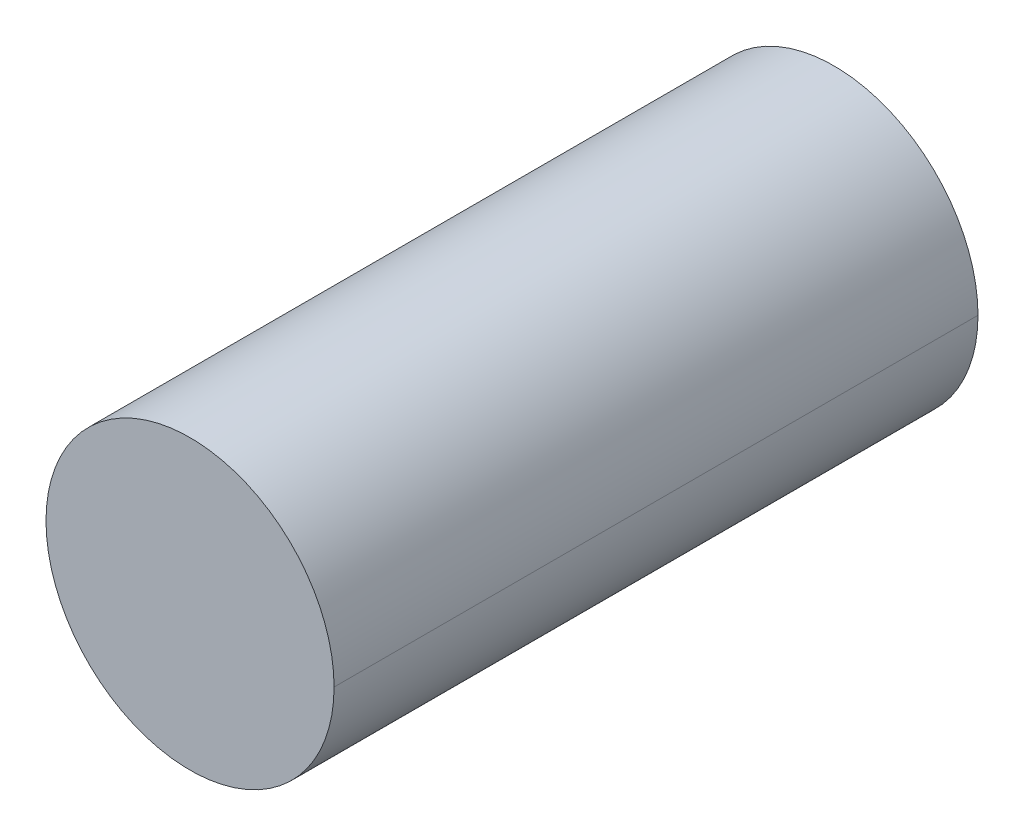
ISO-10303-21;
HEADER;
FILE_DESCRIPTION(('STEP AP214'),'2;1');
FILE_NAME('part.step','',(''),(''),'','','');
FILE_SCHEMA(('AUTOMOTIVE_DESIGN { 1 0 10303 214 1 1 1 1 }'));
ENDSEC;
DATA;
#1=APPLICATION_CONTEXT('core data for automotive mechanical design processes');
#2=APPLICATION_PROTOCOL_DEFINITION('international standard','automotive_design',2000,#1);
#3=PRODUCT_CONTEXT('',#1,'mechanical');
#4=PRODUCT('Part','Part','',(#3));
#5=PRODUCT_RELATED_PRODUCT_CATEGORY('part','',(#4));
#6=PRODUCT_DEFINITION_FORMATION('','',#4);
#7=PRODUCT_DEFINITION_CONTEXT('part definition',#1,'design');
#8=PRODUCT_DEFINITION('design','',#6,#7);
#9=PRODUCT_DEFINITION_SHAPE('','',#8);
#10=(LENGTH_UNIT() NAMED_UNIT(*) SI_UNIT(.MILLI.,.METRE.));
#11=(NAMED_UNIT(*) PLANE_ANGLE_UNIT() SI_UNIT($,.RADIAN.));
#12=(NAMED_UNIT(*) SI_UNIT($,.STERADIAN.) SOLID_ANGLE_UNIT());
#13=UNCERTAINTY_MEASURE_WITH_UNIT(LENGTH_MEASURE(1.E-05),#10,'distance_accuracy_value','');
#14=(GEOMETRIC_REPRESENTATION_CONTEXT(3) GLOBAL_UNCERTAINTY_ASSIGNED_CONTEXT((#13)) GLOBAL_UNIT_ASSIGNED_CONTEXT((#10,
#11,#12)) REPRESENTATION_CONTEXT('',''));
#15=CARTESIAN_POINT('',(0.,0.,0.));
#16=DIRECTION('',(0.,0.,1.));
#17=DIRECTION('',(1.,0.,0.));
#18=AXIS2_PLACEMENT_3D('',#15,#16,#17);
#19=CARTESIAN_POINT('',(0.,0.,0.));
#20=DIRECTION('',(0.,0.,1.));
#21=DIRECTION('',(1.,0.,0.));
#22=AXIS2_PLACEMENT_3D('',#19,#20,#21);
#23=PLANE('',#22);
#24=CARTESIAN_POINT('',(0.,0.,0.));
#25=DIRECTION('',(0.,0.,1.));
#26=DIRECTION('',(1.,0.,0.));
#27=AXIS2_PLACEMENT_3D('',#24,#25,#26);
#28=CIRCLE('',#27,4.25);
#29=CARTESIAN_POINT('',(-4.25,0.,0.));
#30=VERTEX_POINT('',#29);
#31=CARTESIAN_POINT('',(4.25,0.,0.));
#32=VERTEX_POINT('',#31);
#33=EDGE_CURVE('E9',#30,#32,#28,.T.);
#34=ORIENTED_EDGE('',*,*,#33,.F.);
#35=CARTESIAN_POINT('',(0.,0.,0.));
#36=DIRECTION('',(0.,0.,1.));
#37=DIRECTION('',(1.,0.,0.));
#38=AXIS2_PLACEMENT_3D('',#35,#36,#37);
#39=CIRCLE('',#38,4.25);
#40=EDGE_CURVE('E63',#32,#30,#39,.T.);
#41=ORIENTED_EDGE('',*,*,#40,.F.);
#42=EDGE_LOOP('',(#34,#41));
#43=FACE_BOUND('',#42,.T.);
#44=ADVANCED_FACE('F14',(#43),#23,.F.);
#45=CARTESIAN_POINT('',(0.,0.,19.));
#46=DIRECTION('',(0.,0.,1.));
#47=DIRECTION('',(1.,0.,0.));
#48=AXIS2_PLACEMENT_3D('',#45,#46,#47);
#49=PLANE('',#48);
#50=CARTESIAN_POINT('',(0.,0.,19.));
#51=DIRECTION('',(0.,0.,1.));
#52=DIRECTION('',(1.,0.,0.));
#53=AXIS2_PLACEMENT_3D('',#50,#51,#52);
#54=CIRCLE('',#53,4.25);
#55=CARTESIAN_POINT('',(-4.25,0.,19.));
#56=VERTEX_POINT('',#55);
#57=CARTESIAN_POINT('',(4.25,0.,19.));
#58=VERTEX_POINT('',#57);
#59=EDGE_CURVE('E22',#56,#58,#54,.T.);
#60=ORIENTED_EDGE('',*,*,#59,.T.);
#61=CARTESIAN_POINT('',(0.,0.,19.));
#62=DIRECTION('',(0.,0.,1.));
#63=DIRECTION('',(1.,0.,0.));
#64=AXIS2_PLACEMENT_3D('',#61,#62,#63);
#65=CIRCLE('',#64,4.25);
#66=EDGE_CURVE('E52',#58,#56,#65,.T.);
#67=ORIENTED_EDGE('',*,*,#66,.T.);
#68=EDGE_LOOP('',(#60,#67));
#69=FACE_BOUND('',#68,.T.);
#70=ADVANCED_FACE('F50',(#69),#49,.T.);
#71=CARTESIAN_POINT('',(0.,0.,19.));
#72=DIRECTION('',(0.,0.,-1.));
#73=DIRECTION('',(-1.,0.,0.));
#74=AXIS2_PLACEMENT_3D('',#71,#72,#73);
#75=CYLINDRICAL_SURFACE('',#74,4.25);
#76=DIRECTION('',(0.,0.,-1.));
#77=VECTOR('',#76,1.);
#78=CARTESIAN_POINT('',(4.25,0.,19.));
#79=LINE('',#78,#77);
#80=EDGE_CURVE('E58',#58,#32,#79,.T.);
#81=ORIENTED_EDGE('',*,*,#80,.F.);
#82=ORIENTED_EDGE('',*,*,#59,.F.);
#83=DIRECTION('',(0.,0.,-1.));
#84=VECTOR('',#83,1.);
#85=CARTESIAN_POINT('',(-4.25,0.,19.));
#86=LINE('',#85,#84);
#87=EDGE_CURVE('E55',#56,#30,#86,.T.);
#88=ORIENTED_EDGE('',*,*,#87,.T.);
#89=ORIENTED_EDGE('',*,*,#33,.T.);
#90=EDGE_LOOP('',(#81,#82,#88,#89));
#91=FACE_BOUND('',#90,.T.);
#92=ADVANCED_FACE('F59',(#91),#75,.T.);
#93=CARTESIAN_POINT('',(0.,0.,19.));
#94=DIRECTION('',(0.,0.,-1.));
#95=DIRECTION('',(-1.,0.,0.));
#96=AXIS2_PLACEMENT_3D('',#93,#94,#95);
#97=CYLINDRICAL_SURFACE('',#96,4.25);
#98=ORIENTED_EDGE('',*,*,#66,.F.);
#99=ORIENTED_EDGE('',*,*,#80,.T.);
#100=ORIENTED_EDGE('',*,*,#40,.T.);
#101=ORIENTED_EDGE('',*,*,#87,.F.);
#102=EDGE_LOOP('',(#98,#99,#100,#101));
#103=FACE_BOUND('',#102,.T.);
#104=ADVANCED_FACE('F65',(#103),#97,.T.);
#105=CLOSED_SHELL('',(#44,#70,#92,#104));
#106=MANIFOLD_SOLID_BREP('B1',#105);
#107=ADVANCED_BREP_SHAPE_REPRESENTATION('',(#18,#106),#14);
#108=SHAPE_DEFINITION_REPRESENTATION(#9,#107);
ENDSEC;
END-ISO-10303-21;
